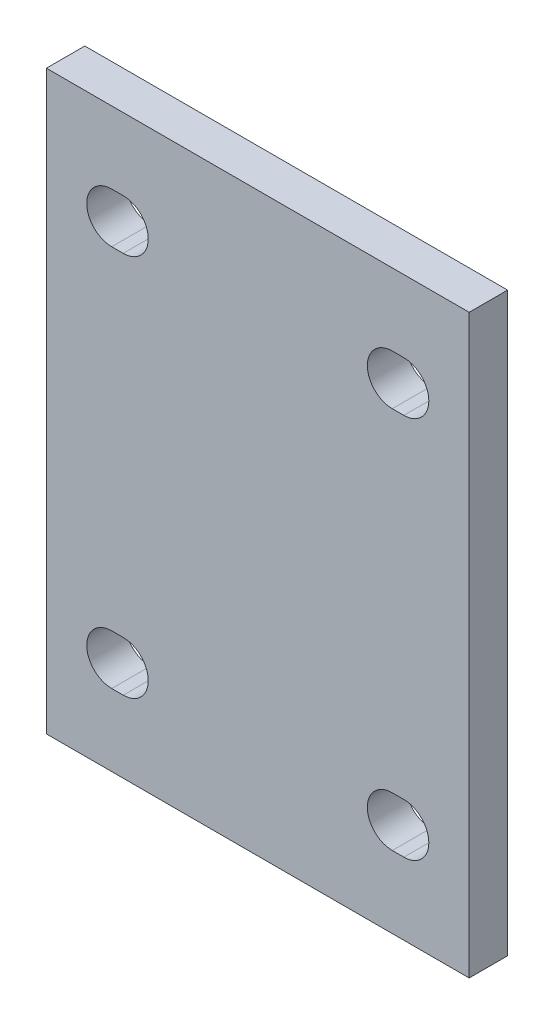
ISO-10303-21;
HEADER;
FILE_DESCRIPTION(('STEP AP214'),'2;1');
FILE_NAME('part.step','',(''),(''),'','','');
FILE_SCHEMA(('AUTOMOTIVE_DESIGN { 1 0 10303 214 1 1 1 1 }'));
ENDSEC;
DATA;
#1=APPLICATION_CONTEXT('core data for automotive mechanical design processes');
#2=APPLICATION_PROTOCOL_DEFINITION('international standard','automotive_design',2000,#1);
#3=PRODUCT_CONTEXT('',#1,'mechanical');
#4=PRODUCT('Part','Part','',(#3));
#5=PRODUCT_RELATED_PRODUCT_CATEGORY('part','',(#4));
#6=PRODUCT_DEFINITION_FORMATION('','',#4);
#7=PRODUCT_DEFINITION_CONTEXT('part definition',#1,'design');
#8=PRODUCT_DEFINITION('design','',#6,#7);
#9=PRODUCT_DEFINITION_SHAPE('','',#8);
#10=(LENGTH_UNIT() NAMED_UNIT(*) SI_UNIT(.MILLI.,.METRE.));
#11=(NAMED_UNIT(*) PLANE_ANGLE_UNIT() SI_UNIT($,.RADIAN.));
#12=(NAMED_UNIT(*) SI_UNIT($,.STERADIAN.) SOLID_ANGLE_UNIT());
#13=UNCERTAINTY_MEASURE_WITH_UNIT(LENGTH_MEASURE(1.E-05),#10,'distance_accuracy_value','');
#14=(GEOMETRIC_REPRESENTATION_CONTEXT(3) GLOBAL_UNCERTAINTY_ASSIGNED_CONTEXT((#13)) GLOBAL_UNIT_ASSIGNED_CONTEXT((#10,
#11,#12)) REPRESENTATION_CONTEXT('',''));
#15=CARTESIAN_POINT('',(0.,0.,0.));
#16=DIRECTION('',(0.,0.,1.));
#17=DIRECTION('',(1.,0.,0.));
#18=AXIS2_PLACEMENT_3D('',#15,#16,#17);
#19=CARTESIAN_POINT('',(-1.11022302462516E-12,0.,39.9999999999998));
#20=DIRECTION('',(0.,0.,0.999999999999999));
#21=DIRECTION('',(1.,0.,0.));
#22=AXIS2_PLACEMENT_3D('',#19,#20,#21);
#23=PLANE('',#22);
#24=CARTESIAN_POINT('',(-57.0000000000006,-49.7727272727274,39.9999999999999));
#25=DIRECTION('',(0.,0.,-0.999999999999999));
#26=DIRECTION('',(-1.,0.,0.));
#27=AXIS2_PLACEMENT_3D('',#24,#25,#26);
#28=CIRCLE('',#27,6.50000000000001);
#29=CARTESIAN_POINT('',(-57.0000000000006,-43.2727272727274,40.0000000000001));
#30=VERTEX_POINT('',#29);
#31=CARTESIAN_POINT('',(-57.0000000000006,-56.2727272727274,39.9999999999999));
#32=VERTEX_POINT('',#31);
#33=EDGE_CURVE('E279',#30,#32,#28,.T.);
#34=ORIENTED_EDGE('',*,*,#33,.T.);
#35=DIRECTION('',(-1.,0.,0.));
#36=VECTOR('',#35,1.);
#37=CARTESIAN_POINT('',(-57.0000000000006,-56.2727272727274,39.9999999999999));
#38=LINE('',#37,#36);
#39=CARTESIAN_POINT('',(-60.0000000000006,-56.2727272727274,39.9999999999996));
#40=VERTEX_POINT('',#39);
#41=EDGE_CURVE('E283',#32,#40,#38,.T.);
#42=ORIENTED_EDGE('',*,*,#41,.T.);
#43=CARTESIAN_POINT('',(-60.0000000000006,-49.7727272727274,40.));
#44=DIRECTION('',(0.,0.,-0.999999999999999));
#45=DIRECTION('',(-1.,0.,0.));
#46=AXIS2_PLACEMENT_3D('',#43,#44,#45);
#47=CIRCLE('',#46,6.50000000000001);
#48=CARTESIAN_POINT('',(-60.0000000000006,-43.2727272727274,39.9999999999997));
#49=VERTEX_POINT('',#48);
#50=EDGE_CURVE('E287',#40,#49,#47,.T.);
#51=ORIENTED_EDGE('',*,*,#50,.T.);
#52=DIRECTION('',(1.,0.,0.));
#53=VECTOR('',#52,1.);
#54=CARTESIAN_POINT('',(-57.0000000000006,-43.2727272727274,40.0000000000001));
#55=LINE('',#54,#53);
#56=EDGE_CURVE('E291',#49,#30,#55,.T.);
#57=ORIENTED_EDGE('',*,*,#56,.T.);
#58=EDGE_LOOP('',(#34,#42,#51,#57));
#59=FACE_BOUND('',#58,.T.);
#60=CARTESIAN_POINT('',(-133.000000000001,-49.7727272727267,40.0000000000004));
#61=DIRECTION('',(0.,0.,-0.999999999999999));
#62=DIRECTION('',(-1.,0.,0.));
#63=AXIS2_PLACEMENT_3D('',#60,#61,#62);
#64=CIRCLE('',#63,6.50000000000002);
#65=CARTESIAN_POINT('',(-133.000000000001,-56.2727272727267,39.9999999999999));
#66=VERTEX_POINT('',#65);
#67=CARTESIAN_POINT('',(-133.000000000001,-43.2727272727267,40.0000000000003));
#68=VERTEX_POINT('',#67);
#69=EDGE_CURVE('E238',#66,#68,#64,.T.);
#70=ORIENTED_EDGE('',*,*,#69,.T.);
#71=DIRECTION('',(1.,0.,0.));
#72=VECTOR('',#71,1.);
#73=CARTESIAN_POINT('',(-133.000000000001,-43.2727272727267,40.0000000000003));
#74=LINE('',#73,#72);
#75=CARTESIAN_POINT('',(-130.000000000001,-43.2727272727272,39.9999999999998));
#76=VERTEX_POINT('',#75);
#77=EDGE_CURVE('E242',#68,#76,#74,.T.);
#78=ORIENTED_EDGE('',*,*,#77,.T.);
#79=CARTESIAN_POINT('',(-130.000000000001,-49.7727272727272,40.));
#80=DIRECTION('',(0.,0.,-0.999999999999999));
#81=DIRECTION('',(-1.,0.,0.));
#82=AXIS2_PLACEMENT_3D('',#79,#80,#81);
#83=CIRCLE('',#82,6.50000000000002);
#84=CARTESIAN_POINT('',(-130.000000000001,-56.2727272727271,39.9999999999996));
#85=VERTEX_POINT('',#84);
#86=EDGE_CURVE('E246',#76,#85,#83,.T.);
#87=ORIENTED_EDGE('',*,*,#86,.T.);
#88=DIRECTION('',(-1.,0.,0.));
#89=VECTOR('',#88,1.);
#90=CARTESIAN_POINT('',(-133.000000000001,-56.2727272727267,39.9999999999999));
#91=LINE('',#90,#89);
#92=EDGE_CURVE('E250',#85,#66,#91,.T.);
#93=ORIENTED_EDGE('',*,*,#92,.T.);
#94=EDGE_LOOP('',(#70,#78,#87,#93));
#95=FACE_BOUND('',#94,.T.);
#96=CARTESIAN_POINT('',(-130.,49.7727272727274,39.9999999999998));
#97=DIRECTION('',(0.,0.,-0.999999999999999));
#98=DIRECTION('',(-1.,0.,0.));
#99=AXIS2_PLACEMENT_3D('',#96,#97,#98);
#100=CIRCLE('',#99,6.5);
#101=CARTESIAN_POINT('',(-130.000000000001,56.2727272727274,39.9999999999997));
#102=VERTEX_POINT('',#101);
#103=CARTESIAN_POINT('',(-130.,43.2727272727275,39.9999999999997));
#104=VERTEX_POINT('',#103);
#105=EDGE_CURVE('E185',#102,#104,#100,.T.);
#106=ORIENTED_EDGE('',*,*,#105,.T.);
#107=DIRECTION('',(-1.,0.,0.));
#108=VECTOR('',#107,1.);
#109=CARTESIAN_POINT('',(-130.,43.2727272727275,39.9999999999997));
#110=LINE('',#109,#108);
#111=CARTESIAN_POINT('',(-133.000000000001,43.2727272727279,40.0000000000003));
#112=VERTEX_POINT('',#111);
#113=EDGE_CURVE('E195',#104,#112,#110,.T.);
#114=ORIENTED_EDGE('',*,*,#113,.T.);
#115=CARTESIAN_POINT('',(-133.000000000001,49.772727272728,40.));
#116=DIRECTION('',(0.,0.,-0.999999999999999));
#117=DIRECTION('',(-1.,0.,0.));
#118=AXIS2_PLACEMENT_3D('',#115,#116,#117);
#119=CIRCLE('',#118,6.5);
#120=CARTESIAN_POINT('',(-133.000000000001,56.2727272727279,40.));
#121=VERTEX_POINT('',#120);
#122=EDGE_CURVE('E202',#112,#121,#119,.T.);
#123=ORIENTED_EDGE('',*,*,#122,.T.);
#124=DIRECTION('',(1.,0.,0.));
#125=VECTOR('',#124,1.);
#126=CARTESIAN_POINT('',(-130.000000000001,56.2727272727274,39.9999999999997));
#127=LINE('',#126,#125);
#128=EDGE_CURVE('E192',#121,#102,#127,.T.);
#129=ORIENTED_EDGE('',*,*,#128,.T.);
#130=EDGE_LOOP('',(#106,#114,#123,#129));
#131=FACE_BOUND('',#130,.T.);
#132=CARTESIAN_POINT('',(-57.0000000000006,49.7727272727273,40.));
#133=DIRECTION('',(0.,0.,-0.999999999999999));
#134=DIRECTION('',(-1.,0.,0.));
#135=AXIS2_PLACEMENT_3D('',#132,#133,#134);
#136=CIRCLE('',#135,6.5);
#137=CARTESIAN_POINT('',(-57.0000000000012,56.2727272727273,39.9999999999998));
#138=VERTEX_POINT('',#137);
#139=CARTESIAN_POINT('',(-57.0000000000011,43.2727272727272,40.));
#140=VERTEX_POINT('',#139);
#141=EDGE_CURVE('E318',#138,#140,#136,.T.);
#142=ORIENTED_EDGE('',*,*,#141,.T.);
#143=DIRECTION('',(-1.,0.,0.));
#144=VECTOR('',#143,1.);
#145=CARTESIAN_POINT('',(-57.0000000000011,43.2727272727272,40.));
#146=LINE('',#145,#144);
#147=CARTESIAN_POINT('',(-60.0000000000006,43.2727272727272,39.9999999999998));
#148=VERTEX_POINT('',#147);
#149=EDGE_CURVE('E322',#140,#148,#146,.T.);
#150=ORIENTED_EDGE('',*,*,#149,.T.);
#151=CARTESIAN_POINT('',(-60.0000000000006,49.7727272727273,39.9999999999998));
#152=DIRECTION('',(0.,0.,-0.999999999999999));
#153=DIRECTION('',(-1.,0.,0.));
#154=AXIS2_PLACEMENT_3D('',#151,#152,#153);
#155=CIRCLE('',#154,6.5);
#156=CARTESIAN_POINT('',(-60.0000000000006,56.2727272727273,39.9999999999998));
#157=VERTEX_POINT('',#156);
#158=EDGE_CURVE('E326',#148,#157,#155,.T.);
#159=ORIENTED_EDGE('',*,*,#158,.T.);
#160=DIRECTION('',(1.,0.,0.));
#161=VECTOR('',#160,1.);
#162=CARTESIAN_POINT('',(-57.0000000000012,56.2727272727273,39.9999999999998));
#163=LINE('',#162,#161);
#164=EDGE_CURVE('E330',#157,#138,#163,.T.);
#165=ORIENTED_EDGE('',*,*,#164,.T.);
#166=EDGE_LOOP('',(#142,#150,#159,#165));
#167=FACE_BOUND('',#166,.T.);
#168=DIRECTION('',(0.,-1.,0.));
#169=VECTOR('',#168,1.);
#170=CARTESIAN_POINT('',(-150.000000000001,-74.9999999999995,40.));
#171=LINE('',#170,#169);
#172=CARTESIAN_POINT('',(-150.,75.0000000000006,40.0000000000001));
#173=VERTEX_POINT('',#172);
#174=CARTESIAN_POINT('',(-150.000000000001,-74.9999999999995,40.));
#175=VERTEX_POINT('',#174);
#176=EDGE_CURVE('E361',#173,#175,#171,.T.);
#177=ORIENTED_EDGE('',*,*,#176,.T.);
#178=DIRECTION('',(1.,0.,0.));
#179=VECTOR('',#178,1.);
#180=CARTESIAN_POINT('',(-39.9999999999995,-75.0000000000002,39.9999999999999));
#181=LINE('',#180,#179);
#182=CARTESIAN_POINT('',(-39.9999999999995,-75.0000000000002,39.9999999999999));
#183=VERTEX_POINT('',#182);
#184=EDGE_CURVE('E365',#175,#183,#181,.T.);
#185=ORIENTED_EDGE('',*,*,#184,.T.);
#186=DIRECTION('',(0.,1.,0.));
#187=VECTOR('',#186,1.);
#188=CARTESIAN_POINT('',(-39.9999999999995,-75.0000000000002,39.9999999999999));
#189=LINE('',#188,#187);
#190=CARTESIAN_POINT('',(-40.,75.0000000000002,40.));
#191=VERTEX_POINT('',#190);
#192=EDGE_CURVE('E369',#183,#191,#189,.T.);
#193=ORIENTED_EDGE('',*,*,#192,.T.);
#194=DIRECTION('',(-1.,0.,0.));
#195=VECTOR('',#194,1.);
#196=CARTESIAN_POINT('',(-40.,75.0000000000002,40.));
#197=LINE('',#196,#195);
#198=EDGE_CURVE('E372',#191,#173,#197,.T.);
#199=ORIENTED_EDGE('',*,*,#198,.T.);
#200=EDGE_LOOP('',(#177,#185,#193,#199));
#201=FACE_BOUND('',#200,.T.);
#202=ADVANCED_FACE('F40',(#59,#95,#131,#167,#201),#23,.T.);
#203=CARTESIAN_POINT('',(-5.55111512312578E-13,5.55111512312578E-13,30.));
#204=DIRECTION('',(0.,0.,0.999999999999999));
#205=DIRECTION('',(1.,0.,0.));
#206=AXIS2_PLACEMENT_3D('',#203,#204,#205);
#207=PLANE('',#206);
#208=DIRECTION('',(0.,-1.,0.));
#209=VECTOR('',#208,1.);
#210=CARTESIAN_POINT('',(-150.,-75.0000000000002,29.9999999999997));
#211=LINE('',#210,#209);
#212=CARTESIAN_POINT('',(-150.,75.,30.));
#213=VERTEX_POINT('',#212);
#214=CARTESIAN_POINT('',(-150.,-75.0000000000002,29.9999999999997));
#215=VERTEX_POINT('',#214);
#216=EDGE_CURVE('E349',#213,#215,#211,.T.);
#217=ORIENTED_EDGE('',*,*,#216,.F.);
#218=DIRECTION('',(-1.,0.,0.));
#219=VECTOR('',#218,1.);
#220=CARTESIAN_POINT('',(-40.0000000000006,75.0000000000002,30.0000000000001));
#221=LINE('',#220,#219);
#222=CARTESIAN_POINT('',(-40.0000000000006,75.0000000000002,30.0000000000001));
#223=VERTEX_POINT('',#222);
#224=EDGE_CURVE('E366',#223,#213,#221,.T.);
#225=ORIENTED_EDGE('',*,*,#224,.F.);
#226=DIRECTION('',(0.,1.,0.));
#227=VECTOR('',#226,1.);
#228=CARTESIAN_POINT('',(-40.0000000000001,-75.,30.));
#229=LINE('',#228,#227);
#230=CARTESIAN_POINT('',(-40.0000000000001,-75.,30.));
#231=VERTEX_POINT('',#230);
#232=EDGE_CURVE('E382',#231,#223,#229,.T.);
#233=ORIENTED_EDGE('',*,*,#232,.F.);
#234=DIRECTION('',(1.,0.,0.));
#235=VECTOR('',#234,1.);
#236=CARTESIAN_POINT('',(-40.0000000000001,-75.,30.));
#237=LINE('',#236,#235);
#238=EDGE_CURVE('E379',#215,#231,#237,.T.);
#239=ORIENTED_EDGE('',*,*,#238,.F.);
#240=EDGE_LOOP('',(#217,#225,#233,#239));
#241=FACE_BOUND('',#240,.T.);
#242=DIRECTION('',(-1.,0.,0.));
#243=VECTOR('',#242,1.);
#244=CARTESIAN_POINT('',(-57.0000000000006,-56.2727272727268,30.));
#245=LINE('',#244,#243);
#246=CARTESIAN_POINT('',(-57.0000000000006,-56.2727272727268,30.));
#247=VERTEX_POINT('',#246);
#248=CARTESIAN_POINT('',(-60.0000000000012,-56.2727272727268,29.9999999999999));
#249=VERTEX_POINT('',#248);
#250=EDGE_CURVE('E297',#247,#249,#245,.T.);
#251=ORIENTED_EDGE('',*,*,#250,.F.);
#252=CARTESIAN_POINT('',(-57.0000000000006,-49.7727272727267,30.));
#253=DIRECTION('',(0.,0.,-0.999999999999999));
#254=DIRECTION('',(-1.,0.,0.));
#255=AXIS2_PLACEMENT_3D('',#252,#253,#254);
#256=CIRCLE('',#255,6.50000000000001);
#257=CARTESIAN_POINT('',(-57.0000000000006,-43.2727272727267,30.0000000000002));
#258=VERTEX_POINT('',#257);
#259=EDGE_CURVE('E56',#258,#247,#256,.T.);
#260=ORIENTED_EDGE('',*,*,#259,.F.);
#261=DIRECTION('',(1.,0.,0.));
#262=VECTOR('',#261,1.);
#263=CARTESIAN_POINT('',(-57.0000000000006,-43.2727272727267,30.0000000000002));
#264=LINE('',#263,#262);
#265=CARTESIAN_POINT('',(-60.0000000000006,-43.2727272727267,30.));
#266=VERTEX_POINT('',#265);
#267=EDGE_CURVE('E284',#266,#258,#264,.T.);
#268=ORIENTED_EDGE('',*,*,#267,.F.);
#269=CARTESIAN_POINT('',(-60.0000000000006,-49.7727272727267,30.0000000000002));
#270=DIRECTION('',(0.,0.,-0.999999999999999));
#271=DIRECTION('',(-1.,0.,0.));
#272=AXIS2_PLACEMENT_3D('',#269,#270,#271);
#273=CIRCLE('',#272,6.50000000000001);
#274=EDGE_CURVE('E300',#249,#266,#273,.T.);
#275=ORIENTED_EDGE('',*,*,#274,.F.);
#276=EDGE_LOOP('',(#251,#260,#268,#275));
#277=FACE_BOUND('',#276,.T.);
#278=DIRECTION('',(1.,0.,0.));
#279=VECTOR('',#278,1.);
#280=CARTESIAN_POINT('',(-133.000000000001,-43.2727272727271,30.));
#281=LINE('',#280,#279);
#282=CARTESIAN_POINT('',(-133.000000000001,-43.2727272727271,30.));
#283=VERTEX_POINT('',#282);
#284=CARTESIAN_POINT('',(-130.000000000001,-43.2727272727271,29.9999999999998));
#285=VERTEX_POINT('',#284);
#286=EDGE_CURVE('E64',#283,#285,#281,.T.);
#287=ORIENTED_EDGE('',*,*,#286,.F.);
#288=CARTESIAN_POINT('',(-133.000000000001,-49.7727272727273,30.0000000000001));
#289=DIRECTION('',(0.,0.,-0.999999999999999));
#290=DIRECTION('',(-1.,0.,0.));
#291=AXIS2_PLACEMENT_3D('',#288,#289,#290);
#292=CIRCLE('',#291,6.50000000000002);
#293=CARTESIAN_POINT('',(-133.000000000001,-56.2727272727273,29.9999999999997));
#294=VERTEX_POINT('',#293);
#295=EDGE_CURVE('E254',#294,#283,#292,.T.);
#296=ORIENTED_EDGE('',*,*,#295,.F.);
#297=DIRECTION('',(-1.,0.,0.));
#298=VECTOR('',#297,1.);
#299=CARTESIAN_POINT('',(-133.000000000001,-56.2727272727273,29.9999999999997));
#300=LINE('',#299,#298);
#301=CARTESIAN_POINT('',(-130.000000000001,-56.2727272727273,29.9999999999996));
#302=VERTEX_POINT('',#301);
#303=EDGE_CURVE('E243',#302,#294,#300,.T.);
#304=ORIENTED_EDGE('',*,*,#303,.F.);
#305=CARTESIAN_POINT('',(-130.000000000001,-49.7727272727273,30.));
#306=DIRECTION('',(0.,0.,-0.999999999999999));
#307=DIRECTION('',(-1.,0.,0.));
#308=AXIS2_PLACEMENT_3D('',#305,#306,#307);
#309=CIRCLE('',#308,6.50000000000002);
#310=EDGE_CURVE('E260',#285,#302,#309,.T.);
#311=ORIENTED_EDGE('',*,*,#310,.F.);
#312=EDGE_LOOP('',(#287,#296,#304,#311));
#313=FACE_BOUND('',#312,.T.);
#314=DIRECTION('',(-1.,0.,0.));
#315=VECTOR('',#314,1.);
#316=CARTESIAN_POINT('',(-57.0000000000002,43.2727272727279,29.9999999999999));
#317=LINE('',#316,#315);
#318=CARTESIAN_POINT('',(-57.0000000000002,43.2727272727279,29.9999999999999));
#319=VERTEX_POINT('',#318);
#320=CARTESIAN_POINT('',(-60.0000000000006,43.2727272727279,30.));
#321=VERTEX_POINT('',#320);
#322=EDGE_CURVE('E336',#319,#321,#317,.T.);
#323=ORIENTED_EDGE('',*,*,#322,.F.);
#324=CARTESIAN_POINT('',(-57.,49.772727272728,30.));
#325=DIRECTION('',(0.,0.,-0.999999999999999));
#326=DIRECTION('',(-1.,0.,0.));
#327=AXIS2_PLACEMENT_3D('',#324,#325,#326);
#328=CIRCLE('',#327,6.5);
#329=CARTESIAN_POINT('',(-57.0000000000006,56.2727272727279,30.));
#330=VERTEX_POINT('',#329);
#331=EDGE_CURVE('E231',#330,#319,#328,.T.);
#332=ORIENTED_EDGE('',*,*,#331,.F.);
#333=DIRECTION('',(1.,0.,0.));
#334=VECTOR('',#333,1.);
#335=CARTESIAN_POINT('',(-57.0000000000006,56.2727272727279,30.));
#336=LINE('',#335,#334);
#337=CARTESIAN_POINT('',(-60.0000000000012,56.2727272727279,29.9999999999999));
#338=VERTEX_POINT('',#337);
#339=EDGE_CURVE('E323',#338,#330,#336,.T.);
#340=ORIENTED_EDGE('',*,*,#339,.F.);
#341=CARTESIAN_POINT('',(-60.0000000000006,49.772727272728,30.));
#342=DIRECTION('',(0.,0.,-0.999999999999999));
#343=DIRECTION('',(-1.,0.,0.));
#344=AXIS2_PLACEMENT_3D('',#341,#342,#343);
#345=CIRCLE('',#344,6.5);
#346=EDGE_CURVE('E339',#321,#338,#345,.T.);
#347=ORIENTED_EDGE('',*,*,#346,.F.);
#348=EDGE_LOOP('',(#323,#332,#340,#347));
#349=FACE_BOUND('',#348,.T.);
#350=DIRECTION('',(-1.,0.,0.));
#351=VECTOR('',#350,1.);
#352=CARTESIAN_POINT('',(-130.000000000001,43.2727272727274,29.9999999999997));
#353=LINE('',#352,#351);
#354=CARTESIAN_POINT('',(-130.000000000001,43.2727272727274,29.9999999999997));
#355=VERTEX_POINT('',#354);
#356=CARTESIAN_POINT('',(-133.000000000001,43.2727272727274,30.));
#357=VERTEX_POINT('',#356);
#358=EDGE_CURVE('E221',#355,#357,#353,.T.);
#359=ORIENTED_EDGE('',*,*,#358,.F.);
#360=CARTESIAN_POINT('',(-130.,49.7727272727275,29.9999999999998));
#361=DIRECTION('',(0.,0.,-0.999999999999999));
#362=DIRECTION('',(-1.,0.,0.));
#363=AXIS2_PLACEMENT_3D('',#360,#361,#362);
#364=CIRCLE('',#363,6.5);
#365=CARTESIAN_POINT('',(-130.000000000001,56.2727272727275,29.9999999999997));
#366=VERTEX_POINT('',#365);
#367=EDGE_CURVE('E187',#366,#355,#364,.T.);
#368=ORIENTED_EDGE('',*,*,#367,.F.);
#369=DIRECTION('',(1.,0.,0.));
#370=VECTOR('',#369,1.);
#371=CARTESIAN_POINT('',(-130.000000000001,56.2727272727275,29.9999999999997));
#372=LINE('',#371,#370);
#373=CARTESIAN_POINT('',(-133.000000000001,56.2727272727275,29.9999999999999));
#374=VERTEX_POINT('',#373);
#375=EDGE_CURVE('E208',#374,#366,#372,.T.);
#376=ORIENTED_EDGE('',*,*,#375,.F.);
#377=CARTESIAN_POINT('',(-133.,49.7727272727275,29.9999999999997));
#378=DIRECTION('',(0.,0.,-0.999999999999999));
#379=DIRECTION('',(-1.,0.,0.));
#380=AXIS2_PLACEMENT_3D('',#377,#378,#379);
#381=CIRCLE('',#380,6.5);
#382=EDGE_CURVE('E212',#357,#374,#381,.T.);
#383=ORIENTED_EDGE('',*,*,#382,.F.);
#384=EDGE_LOOP('',(#359,#368,#376,#383));
#385=FACE_BOUND('',#384,.T.);
#386=ADVANCED_FACE('F406',(#241,#277,#313,#349,#385),#207,.F.);
#387=CARTESIAN_POINT('',(-150.000000000001,-74.9999999999995,40.));
#388=DIRECTION('',(1.,0.,0.));
#389=DIRECTION('',(0.,0.,-0.999999999999999));
#390=AXIS2_PLACEMENT_3D('',#387,#388,#389);
#391=PLANE('',#390);
#392=ORIENTED_EDGE('',*,*,#216,.T.);
#393=DIRECTION('',(0.,0.,-0.999999999999999));
#394=VECTOR('',#393,1.);
#395=CARTESIAN_POINT('',(-150.000000000001,-74.9999999999995,40.));
#396=LINE('',#395,#394);
#397=EDGE_CURVE('E11',#175,#215,#396,.T.);
#398=ORIENTED_EDGE('',*,*,#397,.F.);
#399=ORIENTED_EDGE('',*,*,#176,.F.);
#400=DIRECTION('',(0.,0.,-0.999999999999999));
#401=VECTOR('',#400,1.);
#402=CARTESIAN_POINT('',(-150.,75.0000000000006,40.0000000000001));
#403=LINE('',#402,#401);
#404=EDGE_CURVE('E375',#173,#213,#403,.T.);
#405=ORIENTED_EDGE('',*,*,#404,.T.);
#406=EDGE_LOOP('',(#392,#398,#399,#405));
#407=FACE_BOUND('',#406,.T.);
#408=ADVANCED_FACE('F42',(#407),#391,.F.);
#409=CARTESIAN_POINT('',(-39.9999999999995,-75.0000000000002,39.9999999999999));
#410=DIRECTION('',(0.,1.,0.));
#411=DIRECTION('',(-1.,0.,0.));
#412=AXIS2_PLACEMENT_3D('',#409,#410,#411);
#413=PLANE('',#412);
#414=ORIENTED_EDGE('',*,*,#238,.T.);
#415=DIRECTION('',(0.,0.,-0.999999999999999));
#416=VECTOR('',#415,1.);
#417=CARTESIAN_POINT('',(-39.9999999999995,-75.0000000000002,39.9999999999999));
#418=LINE('',#417,#416);
#419=EDGE_CURVE('E49',#183,#231,#418,.T.);
#420=ORIENTED_EDGE('',*,*,#419,.F.);
#421=ORIENTED_EDGE('',*,*,#184,.F.);
#422=ORIENTED_EDGE('',*,*,#397,.T.);
#423=EDGE_LOOP('',(#414,#420,#421,#422));
#424=FACE_BOUND('',#423,.T.);
#425=ADVANCED_FACE('F416',(#424),#413,.F.);
#426=CARTESIAN_POINT('',(-39.9999999999995,-75.0000000000002,39.9999999999999));
#427=DIRECTION('',(-1.,0.,0.));
#428=DIRECTION('',(0.,0.,0.999999999999999));
#429=AXIS2_PLACEMENT_3D('',#426,#427,#428);
#430=PLANE('',#429);
#431=ORIENTED_EDGE('',*,*,#232,.T.);
#432=DIRECTION('',(0.,0.,-0.999999999999999));
#433=VECTOR('',#432,1.);
#434=CARTESIAN_POINT('',(-40.,75.0000000000002,40.));
#435=LINE('',#434,#433);
#436=EDGE_CURVE('E390',#191,#223,#435,.T.);
#437=ORIENTED_EDGE('',*,*,#436,.F.);
#438=ORIENTED_EDGE('',*,*,#192,.F.);
#439=ORIENTED_EDGE('',*,*,#419,.T.);
#440=EDGE_LOOP('',(#431,#437,#438,#439));
#441=FACE_BOUND('',#440,.T.);
#442=ADVANCED_FACE('F400',(#441),#430,.F.);
#443=CARTESIAN_POINT('',(-40.,75.0000000000002,40.));
#444=DIRECTION('',(0.,-1.,0.));
#445=DIRECTION('',(1.,0.,0.));
#446=AXIS2_PLACEMENT_3D('',#443,#444,#445);
#447=PLANE('',#446);
#448=ORIENTED_EDGE('',*,*,#224,.T.);
#449=ORIENTED_EDGE('',*,*,#404,.F.);
#450=ORIENTED_EDGE('',*,*,#198,.F.);
#451=ORIENTED_EDGE('',*,*,#436,.T.);
#452=EDGE_LOOP('',(#448,#449,#450,#451));
#453=FACE_BOUND('',#452,.T.);
#454=ADVANCED_FACE('F410',(#453),#447,.F.);
#455=CARTESIAN_POINT('',(-57.0000000000012,56.2727272727273,39.9999999999998));
#456=DIRECTION('',(0.,1.,0.));
#457=DIRECTION('',(0.,0.,0.999999999999999));
#458=AXIS2_PLACEMENT_3D('',#455,#456,#457);
#459=PLANE('',#458);
#460=ORIENTED_EDGE('',*,*,#164,.F.);
#461=DIRECTION('',(0.,0.,-0.999999999999999));
#462=VECTOR('',#461,1.);
#463=CARTESIAN_POINT('',(-60.0000000000006,56.2727272727273,39.9999999999998));
#464=LINE('',#463,#462);
#465=EDGE_CURVE('E350',#157,#338,#464,.T.);
#466=ORIENTED_EDGE('',*,*,#465,.T.);
#467=ORIENTED_EDGE('',*,*,#339,.T.);
#468=DIRECTION('',(0.,0.,-0.999999999999999));
#469=VECTOR('',#468,1.);
#470=CARTESIAN_POINT('',(-57.0000000000012,56.2727272727273,39.9999999999998));
#471=LINE('',#470,#469);
#472=EDGE_CURVE('E345',#138,#330,#471,.T.);
#473=ORIENTED_EDGE('',*,*,#472,.F.);
#474=EDGE_LOOP('',(#460,#466,#467,#473));
#475=FACE_BOUND('',#474,.T.);
#476=ADVANCED_FACE('F436',(#475),#459,.F.);
#477=CARTESIAN_POINT('',(-57.0000000000011,43.2727272727272,40.));
#478=DIRECTION('',(0.,-1.,0.));
#479=DIRECTION('',(0.,0.,-0.999999999999999));
#480=AXIS2_PLACEMENT_3D('',#477,#478,#479);
#481=PLANE('',#480);
#482=ORIENTED_EDGE('',*,*,#149,.F.);
#483=DIRECTION('',(0.,0.,-0.999999999999999));
#484=VECTOR('',#483,1.);
#485=CARTESIAN_POINT('',(-57.0000000000011,43.2727272727272,40.));
#486=LINE('',#485,#484);
#487=EDGE_CURVE('E333',#140,#319,#486,.T.);
#488=ORIENTED_EDGE('',*,*,#487,.T.);
#489=ORIENTED_EDGE('',*,*,#322,.T.);
#490=DIRECTION('',(0.,0.,-0.999999999999999));
#491=VECTOR('',#490,1.);
#492=CARTESIAN_POINT('',(-60.0000000000006,43.2727272727272,39.9999999999998));
#493=LINE('',#492,#491);
#494=EDGE_CURVE('E354',#148,#321,#493,.T.);
#495=ORIENTED_EDGE('',*,*,#494,.F.);
#496=EDGE_LOOP('',(#482,#488,#489,#495));
#497=FACE_BOUND('',#496,.T.);
#498=ADVANCED_FACE('F440',(#497),#481,.F.);
#499=CARTESIAN_POINT('',(-57.0000000000006,49.7727272727273,40.));
#500=DIRECTION('',(0.,0.,-0.999999999999999));
#501=DIRECTION('',(-1.,0.,0.));
#502=AXIS2_PLACEMENT_3D('',#499,#500,#501);
#503=CYLINDRICAL_SURFACE('',#502,6.5);
#504=ORIENTED_EDGE('',*,*,#331,.T.);
#505=ORIENTED_EDGE('',*,*,#487,.F.);
#506=ORIENTED_EDGE('',*,*,#141,.F.);
#507=ORIENTED_EDGE('',*,*,#472,.T.);
#508=EDGE_LOOP('',(#504,#505,#506,#507));
#509=FACE_BOUND('',#508,.T.);
#510=ADVANCED_FACE('F432',(#509),#503,.F.);
#511=CARTESIAN_POINT('',(-60.0000000000006,49.7727272727273,39.9999999999998));
#512=DIRECTION('',(0.,0.,-0.999999999999999));
#513=DIRECTION('',(-1.,0.,0.));
#514=AXIS2_PLACEMENT_3D('',#511,#512,#513);
#515=CYLINDRICAL_SURFACE('',#514,6.5);
#516=ORIENTED_EDGE('',*,*,#346,.T.);
#517=ORIENTED_EDGE('',*,*,#465,.F.);
#518=ORIENTED_EDGE('',*,*,#158,.F.);
#519=ORIENTED_EDGE('',*,*,#494,.T.);
#520=EDGE_LOOP('',(#516,#517,#518,#519));
#521=FACE_BOUND('',#520,.T.);
#522=ADVANCED_FACE('F452',(#521),#515,.F.);
#523=CARTESIAN_POINT('',(-130.000000000001,56.2727272727274,39.9999999999997));
#524=DIRECTION('',(0.,1.,0.));
#525=DIRECTION('',(0.,0.,0.999999999999999));
#526=AXIS2_PLACEMENT_3D('',#523,#524,#525);
#527=PLANE('',#526);
#528=ORIENTED_EDGE('',*,*,#128,.F.);
#529=DIRECTION('',(0.,0.,-0.999999999999999));
#530=VECTOR('',#529,1.);
#531=CARTESIAN_POINT('',(-133.000000000001,56.2727272727279,40.));
#532=LINE('',#531,#530);
#533=EDGE_CURVE('E232',#121,#374,#532,.T.);
#534=ORIENTED_EDGE('',*,*,#533,.T.);
#535=ORIENTED_EDGE('',*,*,#375,.T.);
#536=DIRECTION('',(0.,0.,-0.999999999999999));
#537=VECTOR('',#536,1.);
#538=CARTESIAN_POINT('',(-130.000000000001,56.2727272727274,39.9999999999997));
#539=LINE('',#538,#537);
#540=EDGE_CURVE('E228',#102,#366,#539,.T.);
#541=ORIENTED_EDGE('',*,*,#540,.F.);
#542=EDGE_LOOP('',(#528,#534,#535,#541));
#543=FACE_BOUND('',#542,.T.);
#544=ADVANCED_FACE('F454',(#543),#527,.F.);
#545=CARTESIAN_POINT('',(-130.,43.2727272727275,39.9999999999997));
#546=DIRECTION('',(0.,-1.,0.));
#547=DIRECTION('',(0.,0.,-0.999999999999999));
#548=AXIS2_PLACEMENT_3D('',#545,#546,#547);
#549=PLANE('',#548);
#550=ORIENTED_EDGE('',*,*,#113,.F.);
#551=DIRECTION('',(0.,0.,-0.999999999999999));
#552=VECTOR('',#551,1.);
#553=CARTESIAN_POINT('',(-130.,43.2727272727275,39.9999999999997));
#554=LINE('',#553,#552);
#555=EDGE_CURVE('E180',#104,#355,#554,.T.);
#556=ORIENTED_EDGE('',*,*,#555,.T.);
#557=ORIENTED_EDGE('',*,*,#358,.T.);
#558=DIRECTION('',(0.,0.,-0.999999999999999));
#559=VECTOR('',#558,1.);
#560=CARTESIAN_POINT('',(-133.000000000001,43.2727272727279,40.0000000000003));
#561=LINE('',#560,#559);
#562=EDGE_CURVE('E191',#112,#357,#561,.T.);
#563=ORIENTED_EDGE('',*,*,#562,.F.);
#564=EDGE_LOOP('',(#550,#556,#557,#563));
#565=FACE_BOUND('',#564,.T.);
#566=ADVANCED_FACE('F196',(#565),#549,.F.);
#567=CARTESIAN_POINT('',(-130.,49.7727272727274,39.9999999999998));
#568=DIRECTION('',(0.,0.,-0.999999999999999));
#569=DIRECTION('',(-1.,0.,0.));
#570=AXIS2_PLACEMENT_3D('',#567,#568,#569);
#571=CYLINDRICAL_SURFACE('',#570,6.5);
#572=ORIENTED_EDGE('',*,*,#367,.T.);
#573=ORIENTED_EDGE('',*,*,#555,.F.);
#574=ORIENTED_EDGE('',*,*,#105,.F.);
#575=ORIENTED_EDGE('',*,*,#540,.T.);
#576=EDGE_LOOP('',(#572,#573,#574,#575));
#577=FACE_BOUND('',#576,.T.);
#578=ADVANCED_FACE('F182',(#577),#571,.F.);
#579=CARTESIAN_POINT('',(-133.000000000001,49.772727272728,40.));
#580=DIRECTION('',(0.,0.,-0.999999999999999));
#581=DIRECTION('',(-1.,0.,0.));
#582=AXIS2_PLACEMENT_3D('',#579,#580,#581);
#583=CYLINDRICAL_SURFACE('',#582,6.5);
#584=ORIENTED_EDGE('',*,*,#382,.T.);
#585=ORIENTED_EDGE('',*,*,#533,.F.);
#586=ORIENTED_EDGE('',*,*,#122,.F.);
#587=ORIENTED_EDGE('',*,*,#562,.T.);
#588=EDGE_LOOP('',(#584,#585,#586,#587));
#589=FACE_BOUND('',#588,.T.);
#590=ADVANCED_FACE('F475',(#589),#583,.F.);
#591=CARTESIAN_POINT('',(-133.000000000001,-56.2727272727267,39.9999999999999));
#592=DIRECTION('',(0.,-1.,0.));
#593=DIRECTION('',(0.,0.,-0.999999999999999));
#594=AXIS2_PLACEMENT_3D('',#591,#592,#593);
#595=PLANE('',#594);
#596=ORIENTED_EDGE('',*,*,#92,.F.);
#597=DIRECTION('',(0.,0.,-0.999999999999999));
#598=VECTOR('',#597,1.);
#599=CARTESIAN_POINT('',(-130.000000000001,-56.2727272727271,39.9999999999996));
#600=LINE('',#599,#598);
#601=EDGE_CURVE('E269',#85,#302,#600,.T.);
#602=ORIENTED_EDGE('',*,*,#601,.T.);
#603=ORIENTED_EDGE('',*,*,#303,.T.);
#604=DIRECTION('',(0.,0.,-0.999999999999999));
#605=VECTOR('',#604,1.);
#606=CARTESIAN_POINT('',(-133.000000000001,-56.2727272727267,39.9999999999999));
#607=LINE('',#606,#605);
#608=EDGE_CURVE('E222',#66,#294,#607,.T.);
#609=ORIENTED_EDGE('',*,*,#608,.F.);
#610=EDGE_LOOP('',(#596,#602,#603,#609));
#611=FACE_BOUND('',#610,.T.);
#612=ADVANCED_FACE('F477',(#611),#595,.F.);
#613=CARTESIAN_POINT('',(-133.000000000001,-43.2727272727267,40.0000000000003));
#614=DIRECTION('',(0.,1.,0.));
#615=DIRECTION('',(0.,0.,0.999999999999999));
#616=AXIS2_PLACEMENT_3D('',#613,#614,#615);
#617=PLANE('',#616);
#618=ORIENTED_EDGE('',*,*,#77,.F.);
#619=DIRECTION('',(0.,0.,-0.999999999999999));
#620=VECTOR('',#619,1.);
#621=CARTESIAN_POINT('',(-133.000000000001,-43.2727272727267,40.0000000000003));
#622=LINE('',#621,#620);
#623=EDGE_CURVE('E253',#68,#283,#622,.T.);
#624=ORIENTED_EDGE('',*,*,#623,.T.);
#625=ORIENTED_EDGE('',*,*,#286,.T.);
#626=DIRECTION('',(0.,0.,-0.999999999999999));
#627=VECTOR('',#626,1.);
#628=CARTESIAN_POINT('',(-130.000000000001,-43.2727272727272,39.9999999999998));
#629=LINE('',#628,#627);
#630=EDGE_CURVE('E272',#76,#285,#629,.T.);
#631=ORIENTED_EDGE('',*,*,#630,.F.);
#632=EDGE_LOOP('',(#618,#624,#625,#631));
#633=FACE_BOUND('',#632,.T.);
#634=ADVANCED_FACE('F483',(#633),#617,.F.);
#635=CARTESIAN_POINT('',(-133.000000000001,-49.7727272727267,40.0000000000004));
#636=DIRECTION('',(0.,0.,-0.999999999999999));
#637=DIRECTION('',(-1.,0.,0.));
#638=AXIS2_PLACEMENT_3D('',#635,#636,#637);
#639=CYLINDRICAL_SURFACE('',#638,6.50000000000002);
#640=ORIENTED_EDGE('',*,*,#295,.T.);
#641=ORIENTED_EDGE('',*,*,#623,.F.);
#642=ORIENTED_EDGE('',*,*,#69,.F.);
#643=ORIENTED_EDGE('',*,*,#608,.T.);
#644=EDGE_LOOP('',(#640,#641,#642,#643));
#645=FACE_BOUND('',#644,.T.);
#646=ADVANCED_FACE('F494',(#645),#639,.F.);
#647=CARTESIAN_POINT('',(-130.000000000001,-49.7727272727272,40.));
#648=DIRECTION('',(0.,0.,-0.999999999999999));
#649=DIRECTION('',(-1.,0.,0.));
#650=AXIS2_PLACEMENT_3D('',#647,#648,#649);
#651=CYLINDRICAL_SURFACE('',#650,6.50000000000002);
#652=ORIENTED_EDGE('',*,*,#310,.T.);
#653=ORIENTED_EDGE('',*,*,#601,.F.);
#654=ORIENTED_EDGE('',*,*,#86,.F.);
#655=ORIENTED_EDGE('',*,*,#630,.T.);
#656=EDGE_LOOP('',(#652,#653,#654,#655));
#657=FACE_BOUND('',#656,.T.);
#658=ADVANCED_FACE('F490',(#657),#651,.F.);
#659=CARTESIAN_POINT('',(-57.0000000000006,-43.2727272727274,40.0000000000001));
#660=DIRECTION('',(0.,1.,0.));
#661=DIRECTION('',(0.,0.,0.999999999999999));
#662=AXIS2_PLACEMENT_3D('',#659,#660,#661);
#663=PLANE('',#662);
#664=ORIENTED_EDGE('',*,*,#56,.F.);
#665=DIRECTION('',(0.,0.,-0.999999999999999));
#666=VECTOR('',#665,1.);
#667=CARTESIAN_POINT('',(-60.0000000000006,-43.2727272727274,39.9999999999997));
#668=LINE('',#667,#666);
#669=EDGE_CURVE('E308',#49,#266,#668,.T.);
#670=ORIENTED_EDGE('',*,*,#669,.T.);
#671=ORIENTED_EDGE('',*,*,#267,.T.);
#672=DIRECTION('',(0.,0.,-0.999999999999999));
#673=VECTOR('',#672,1.);
#674=CARTESIAN_POINT('',(-57.0000000000006,-43.2727272727274,40.0000000000001));
#675=LINE('',#674,#673);
#676=EDGE_CURVE('E257',#30,#258,#675,.T.);
#677=ORIENTED_EDGE('',*,*,#676,.F.);
#678=EDGE_LOOP('',(#664,#670,#671,#677));
#679=FACE_BOUND('',#678,.T.);
#680=ADVANCED_FACE('F493',(#679),#663,.F.);
#681=CARTESIAN_POINT('',(-57.0000000000006,-56.2727272727274,39.9999999999999));
#682=DIRECTION('',(0.,-1.,0.));
#683=DIRECTION('',(0.,0.,-0.999999999999999));
#684=AXIS2_PLACEMENT_3D('',#681,#682,#683);
#685=PLANE('',#684);
#686=ORIENTED_EDGE('',*,*,#41,.F.);
#687=DIRECTION('',(0.,0.,-0.999999999999999));
#688=VECTOR('',#687,1.);
#689=CARTESIAN_POINT('',(-57.0000000000006,-56.2727272727274,39.9999999999999));
#690=LINE('',#689,#688);
#691=EDGE_CURVE('E294',#32,#247,#690,.T.);
#692=ORIENTED_EDGE('',*,*,#691,.T.);
#693=ORIENTED_EDGE('',*,*,#250,.T.);
#694=DIRECTION('',(0.,0.,-0.999999999999999));
#695=VECTOR('',#694,1.);
#696=CARTESIAN_POINT('',(-60.0000000000006,-56.2727272727274,39.9999999999996));
#697=LINE('',#696,#695);
#698=EDGE_CURVE('E312',#40,#249,#697,.T.);
#699=ORIENTED_EDGE('',*,*,#698,.F.);
#700=EDGE_LOOP('',(#686,#692,#693,#699));
#701=FACE_BOUND('',#700,.T.);
#702=ADVANCED_FACE('F504',(#701),#685,.F.);
#703=CARTESIAN_POINT('',(-57.0000000000006,-49.7727272727274,39.9999999999999));
#704=DIRECTION('',(0.,0.,-0.999999999999999));
#705=DIRECTION('',(-1.,0.,0.));
#706=AXIS2_PLACEMENT_3D('',#703,#704,#705);
#707=CYLINDRICAL_SURFACE('',#706,6.50000000000001);
#708=ORIENTED_EDGE('',*,*,#259,.T.);
#709=ORIENTED_EDGE('',*,*,#691,.F.);
#710=ORIENTED_EDGE('',*,*,#33,.F.);
#711=ORIENTED_EDGE('',*,*,#676,.T.);
#712=EDGE_LOOP('',(#708,#709,#710,#711));
#713=FACE_BOUND('',#712,.T.);
#714=ADVANCED_FACE('F450',(#713),#707,.F.);
#715=CARTESIAN_POINT('',(-60.0000000000006,-49.7727272727274,40.));
#716=DIRECTION('',(0.,0.,-0.999999999999999));
#717=DIRECTION('',(-1.,0.,0.));
#718=AXIS2_PLACEMENT_3D('',#715,#716,#717);
#719=CYLINDRICAL_SURFACE('',#718,6.50000000000001);
#720=ORIENTED_EDGE('',*,*,#274,.T.);
#721=ORIENTED_EDGE('',*,*,#669,.F.);
#722=ORIENTED_EDGE('',*,*,#50,.F.);
#723=ORIENTED_EDGE('',*,*,#698,.T.);
#724=EDGE_LOOP('',(#720,#721,#722,#723));
#725=FACE_BOUND('',#724,.T.);
#726=ADVANCED_FACE('F506',(#725),#719,.F.);
#727=CLOSED_SHELL('',(#202,#386,#408,#425,#442,#454,#476,#498,#510,#522,#544,#566,#578,#590,
#612,#634,#646,#658,#680,#702,#714,#726));
#728=MANIFOLD_SOLID_BREP('B2',#727);
#729=ADVANCED_BREP_SHAPE_REPRESENTATION('',(#18,#728),#14);
#730=SHAPE_DEFINITION_REPRESENTATION(#9,#729);
ENDSEC;
END-ISO-10303-21;
